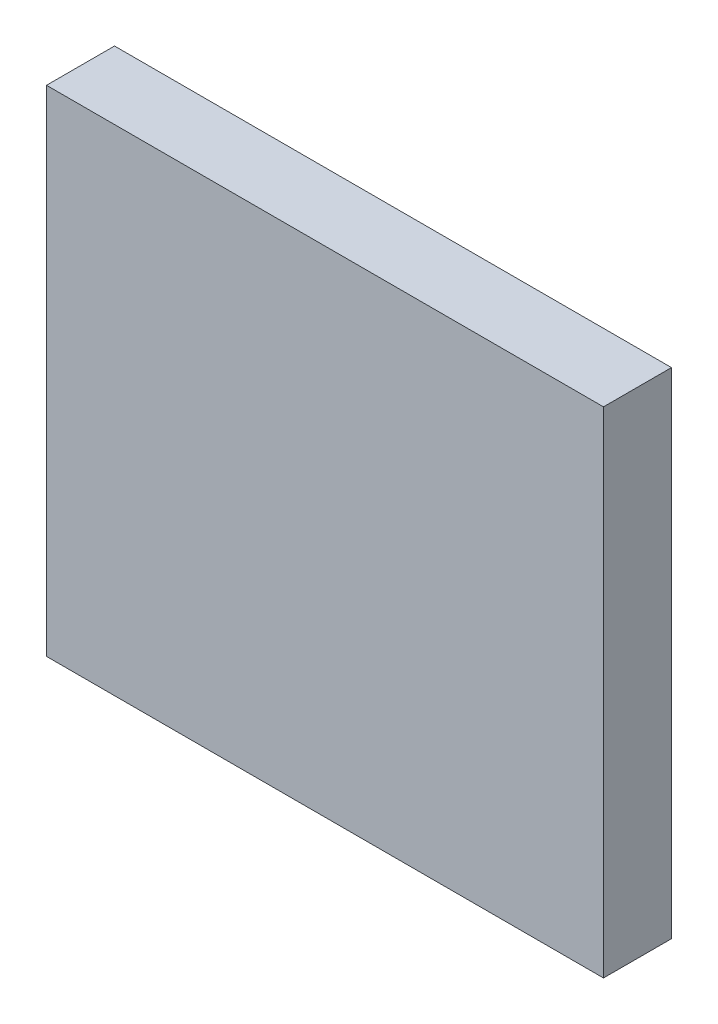
ISO-10303-21;
HEADER;
FILE_DESCRIPTION(('STEP AP214'),'2;1');
FILE_NAME('part.step','',(''),(''),'','','');
FILE_SCHEMA(('AUTOMOTIVE_DESIGN { 1 0 10303 214 1 1 1 1 }'));
ENDSEC;
DATA;
#1=APPLICATION_CONTEXT('core data for automotive mechanical design processes');
#2=APPLICATION_PROTOCOL_DEFINITION('international standard','automotive_design',2000,#1);
#3=PRODUCT_CONTEXT('',#1,'mechanical');
#4=PRODUCT('Part','Part','',(#3));
#5=PRODUCT_RELATED_PRODUCT_CATEGORY('part','',(#4));
#6=PRODUCT_DEFINITION_FORMATION('','',#4);
#7=PRODUCT_DEFINITION_CONTEXT('part definition',#1,'design');
#8=PRODUCT_DEFINITION('design','',#6,#7);
#9=PRODUCT_DEFINITION_SHAPE('','',#8);
#10=(LENGTH_UNIT() NAMED_UNIT(*) SI_UNIT(.MILLI.,.METRE.));
#11=(NAMED_UNIT(*) PLANE_ANGLE_UNIT() SI_UNIT($,.RADIAN.));
#12=(NAMED_UNIT(*) SI_UNIT($,.STERADIAN.) SOLID_ANGLE_UNIT());
#13=UNCERTAINTY_MEASURE_WITH_UNIT(LENGTH_MEASURE(1.E-05),#10,'distance_accuracy_value','');
#14=(GEOMETRIC_REPRESENTATION_CONTEXT(3) GLOBAL_UNCERTAINTY_ASSIGNED_CONTEXT((#13)) GLOBAL_UNIT_ASSIGNED_CONTEXT((#10,
#11,#12)) REPRESENTATION_CONTEXT('',''));
#15=CARTESIAN_POINT('',(0.,0.,0.));
#16=DIRECTION('',(0.,0.,1.));
#17=DIRECTION('',(1.,0.,0.));
#18=AXIS2_PLACEMENT_3D('',#15,#16,#17);
#19=CARTESIAN_POINT('',(46.7153757819131,-43.6108729609632,10.));
#20=DIRECTION('',(-1.,0.,0.));
#21=DIRECTION('',(0.,0.,1.));
#22=AXIS2_PLACEMENT_3D('',#19,#20,#21);
#23=PLANE('',#22);
#24=DIRECTION('',(0.,1.,0.));
#25=VECTOR('',#24,1.);
#26=CARTESIAN_POINT('',(46.7153757819131,-43.6108729609632,0.));
#27=LINE('',#26,#25);
#28=CARTESIAN_POINT('',(46.7153757819131,-43.6108729609632,0.));
#29=VERTEX_POINT('',#28);
#30=CARTESIAN_POINT('',(46.7153757819131,29.1231931298636,0.));
#31=VERTEX_POINT('',#30);
#32=EDGE_CURVE('E96',#29,#31,#27,.T.);
#33=ORIENTED_EDGE('',*,*,#32,.T.);
#34=DIRECTION('',(0.,0.,-1.));
#35=VECTOR('',#34,1.);
#36=CARTESIAN_POINT('',(46.7153757819131,29.1231931298636,10.));
#37=LINE('',#36,#35);
#38=CARTESIAN_POINT('',(46.7153757819131,29.1231931298636,10.));
#39=VERTEX_POINT('',#38);
#40=EDGE_CURVE('E11',#39,#31,#37,.T.);
#41=ORIENTED_EDGE('',*,*,#40,.F.);
#42=DIRECTION('',(0.,1.,0.));
#43=VECTOR('',#42,1.);
#44=CARTESIAN_POINT('',(46.7153757819131,-43.6108729609632,10.));
#45=LINE('',#44,#43);
#46=CARTESIAN_POINT('',(46.7153757819131,-43.6108729609632,10.));
#47=VERTEX_POINT('',#46);
#48=EDGE_CURVE('E84',#47,#39,#45,.T.);
#49=ORIENTED_EDGE('',*,*,#48,.F.);
#50=DIRECTION('',(0.,0.,-1.));
#51=VECTOR('',#50,1.);
#52=CARTESIAN_POINT('',(46.7153757819131,-43.6108729609632,10.));
#53=LINE('',#52,#51);
#54=EDGE_CURVE('E92',#47,#29,#53,.T.);
#55=ORIENTED_EDGE('',*,*,#54,.T.);
#56=EDGE_LOOP('',(#33,#41,#49,#55));
#57=FACE_BOUND('',#56,.T.);
#58=ADVANCED_FACE('F33',(#57),#23,.F.);
#59=CARTESIAN_POINT('',(46.7153757819131,29.1231931298636,10.));
#60=DIRECTION('',(0.,-1.,0.));
#61=DIRECTION('',(0.,0.,-1.));
#62=AXIS2_PLACEMENT_3D('',#59,#60,#61);
#63=PLANE('',#62);
#64=DIRECTION('',(-1.,0.,0.));
#65=VECTOR('',#64,1.);
#66=CARTESIAN_POINT('',(46.7153757819131,29.1231931298636,0.));
#67=LINE('',#66,#65);
#68=CARTESIAN_POINT('',(-35.1843653040991,29.1231931298636,0.));
#69=VERTEX_POINT('',#68);
#70=EDGE_CURVE('E88',#31,#69,#67,.T.);
#71=ORIENTED_EDGE('',*,*,#70,.T.);
#72=DIRECTION('',(0.,0.,-1.));
#73=VECTOR('',#72,1.);
#74=CARTESIAN_POINT('',(-35.1843653040991,29.1231931298636,10.));
#75=LINE('',#74,#73);
#76=CARTESIAN_POINT('',(-35.1843653040991,29.1231931298636,10.));
#77=VERTEX_POINT('',#76);
#78=EDGE_CURVE('E41',#77,#69,#75,.T.);
#79=ORIENTED_EDGE('',*,*,#78,.F.);
#80=DIRECTION('',(-1.,0.,0.));
#81=VECTOR('',#80,1.);
#82=CARTESIAN_POINT('',(46.7153757819131,29.1231931298636,10.));
#83=LINE('',#82,#81);
#84=EDGE_CURVE('E79',#39,#77,#83,.T.);
#85=ORIENTED_EDGE('',*,*,#84,.F.);
#86=ORIENTED_EDGE('',*,*,#40,.T.);
#87=EDGE_LOOP('',(#71,#79,#85,#86));
#88=FACE_BOUND('',#87,.T.);
#89=ADVANCED_FACE('F87',(#88),#63,.F.);
#90=CARTESIAN_POINT('',(-35.1843653040991,29.1231931298636,10.));
#91=DIRECTION('',(1.,0.,0.));
#92=DIRECTION('',(0.,0.,-1.));
#93=AXIS2_PLACEMENT_3D('',#90,#91,#92);
#94=PLANE('',#93);
#95=DIRECTION('',(0.,-1.,0.));
#96=VECTOR('',#95,1.);
#97=CARTESIAN_POINT('',(-35.1843653040991,29.1231931298636,0.));
#98=LINE('',#97,#96);
#99=CARTESIAN_POINT('',(-35.1843653040991,-43.6108729609632,0.));
#100=VERTEX_POINT('',#99);
#101=EDGE_CURVE('E66',#69,#100,#98,.T.);
#102=ORIENTED_EDGE('',*,*,#101,.T.);
#103=DIRECTION('',(0.,0.,-1.));
#104=VECTOR('',#103,1.);
#105=CARTESIAN_POINT('',(-35.1843653040991,-43.6108729609632,10.));
#106=LINE('',#105,#104);
#107=CARTESIAN_POINT('',(-35.1843653040991,-43.6108729609632,10.));
#108=VERTEX_POINT('',#107);
#109=EDGE_CURVE('E89',#108,#100,#106,.T.);
#110=ORIENTED_EDGE('',*,*,#109,.F.);
#111=DIRECTION('',(0.,-1.,0.));
#112=VECTOR('',#111,1.);
#113=CARTESIAN_POINT('',(-35.1843653040991,29.1231931298636,10.));
#114=LINE('',#113,#112);
#115=EDGE_CURVE('E82',#77,#108,#114,.T.);
#116=ORIENTED_EDGE('',*,*,#115,.F.);
#117=ORIENTED_EDGE('',*,*,#78,.T.);
#118=EDGE_LOOP('',(#102,#110,#116,#117));
#119=FACE_BOUND('',#118,.T.);
#120=ADVANCED_FACE('F90',(#119),#94,.F.);
#121=CARTESIAN_POINT('',(-35.1843653040991,-43.6108729609632,10.));
#122=DIRECTION('',(0.,1.,0.));
#123=DIRECTION('',(0.,0.,1.));
#124=AXIS2_PLACEMENT_3D('',#121,#122,#123);
#125=PLANE('',#124);
#126=DIRECTION('',(1.,0.,0.));
#127=VECTOR('',#126,1.);
#128=CARTESIAN_POINT('',(-35.1843653040991,-43.6108729609632,0.));
#129=LINE('',#128,#127);
#130=EDGE_CURVE('E72',#100,#29,#129,.T.);
#131=ORIENTED_EDGE('',*,*,#130,.T.);
#132=ORIENTED_EDGE('',*,*,#54,.F.);
#133=DIRECTION('',(1.,0.,0.));
#134=VECTOR('',#133,1.);
#135=CARTESIAN_POINT('',(-35.1843653040991,-43.6108729609632,10.));
#136=LINE('',#135,#134);
#137=EDGE_CURVE('E49',#108,#47,#136,.T.);
#138=ORIENTED_EDGE('',*,*,#137,.F.);
#139=ORIENTED_EDGE('',*,*,#109,.T.);
#140=EDGE_LOOP('',(#131,#132,#138,#139));
#141=FACE_BOUND('',#140,.T.);
#142=ADVANCED_FACE('F103',(#141),#125,.F.);
#143=CARTESIAN_POINT('',(0.,0.,10.));
#144=DIRECTION('',(0.,0.,1.));
#145=DIRECTION('',(1.,0.,0.));
#146=AXIS2_PLACEMENT_3D('',#143,#144,#145);
#147=PLANE('',#146);
#148=ORIENTED_EDGE('',*,*,#48,.T.);
#149=ORIENTED_EDGE('',*,*,#84,.T.);
#150=ORIENTED_EDGE('',*,*,#115,.T.);
#151=ORIENTED_EDGE('',*,*,#137,.T.);
#152=EDGE_LOOP('',(#148,#149,#150,#151));
#153=FACE_BOUND('',#152,.T.);
#154=ADVANCED_FACE('F80',(#153),#147,.T.);
#155=CARTESIAN_POINT('',(0.,0.,0.));
#156=DIRECTION('',(0.,0.,1.));
#157=DIRECTION('',(1.,0.,0.));
#158=AXIS2_PLACEMENT_3D('',#155,#156,#157);
#159=PLANE('',#158);
#160=ORIENTED_EDGE('',*,*,#32,.F.);
#161=ORIENTED_EDGE('',*,*,#130,.F.);
#162=ORIENTED_EDGE('',*,*,#101,.F.);
#163=ORIENTED_EDGE('',*,*,#70,.F.);
#164=EDGE_LOOP('',(#160,#161,#162,#163));
#165=FACE_BOUND('',#164,.T.);
#166=ADVANCED_FACE('F106',(#165),#159,.F.);
#167=CLOSED_SHELL('',(#58,#89,#120,#142,#154,#166));
#168=MANIFOLD_SOLID_BREP('B2',#167);
#169=ADVANCED_BREP_SHAPE_REPRESENTATION('',(#18,#168),#14);
#170=SHAPE_DEFINITION_REPRESENTATION(#9,#169);
ENDSEC;
END-ISO-10303-21;
